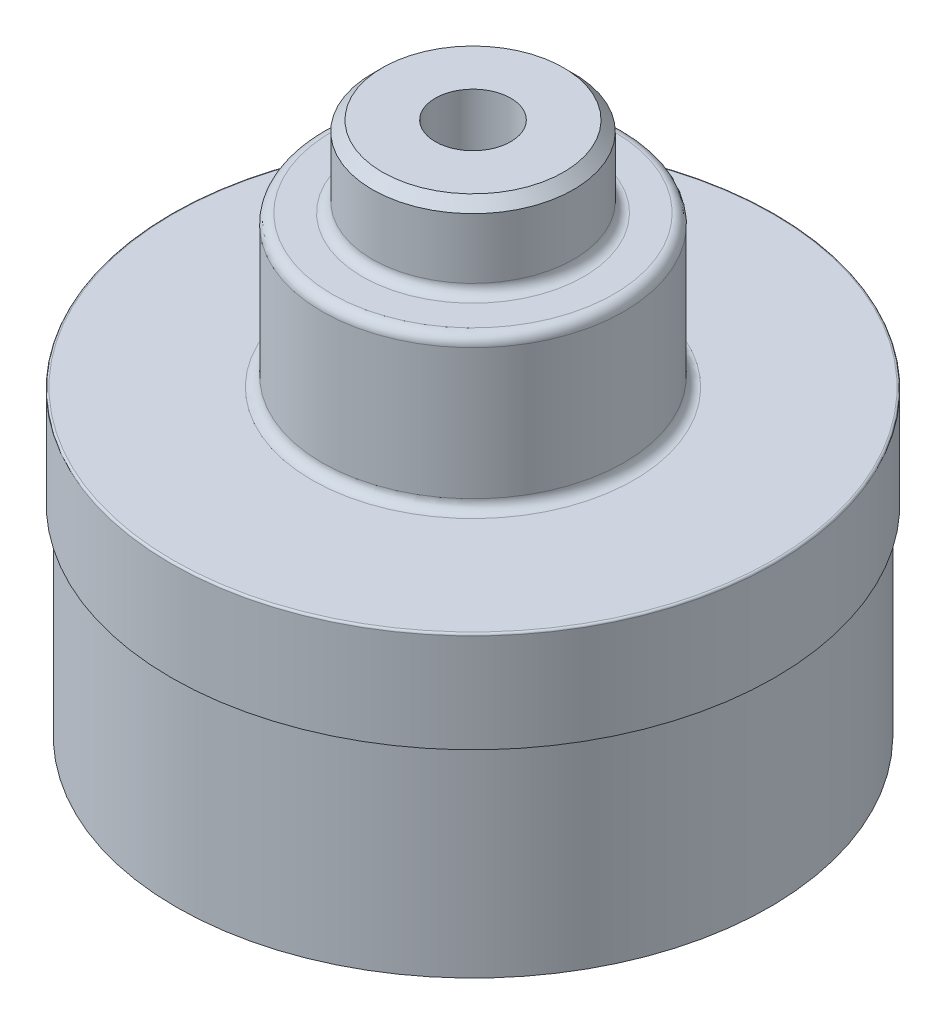
ISO-10303-21;
HEADER;
FILE_DESCRIPTION(('STEP AP214'),'2;1');
FILE_NAME('part.step','',(''),(''),'','','');
FILE_SCHEMA(('AUTOMOTIVE_DESIGN { 1 0 10303 214 1 1 1 1 }'));
ENDSEC;
DATA;
#1=APPLICATION_CONTEXT('core data for automotive mechanical design processes');
#2=APPLICATION_PROTOCOL_DEFINITION('international standard','automotive_design',2000,#1);
#3=PRODUCT_CONTEXT('',#1,'mechanical');
#4=PRODUCT('Part','Part','',(#3));
#5=PRODUCT_RELATED_PRODUCT_CATEGORY('part','',(#4));
#6=PRODUCT_DEFINITION_FORMATION('','',#4);
#7=PRODUCT_DEFINITION_CONTEXT('part definition',#1,'design');
#8=PRODUCT_DEFINITION('design','',#6,#7);
#9=PRODUCT_DEFINITION_SHAPE('','',#8);
#10=(LENGTH_UNIT() NAMED_UNIT(*) SI_UNIT(.MILLI.,.METRE.));
#11=(NAMED_UNIT(*) PLANE_ANGLE_UNIT() SI_UNIT($,.RADIAN.));
#12=(NAMED_UNIT(*) SI_UNIT($,.STERADIAN.) SOLID_ANGLE_UNIT());
#13=UNCERTAINTY_MEASURE_WITH_UNIT(LENGTH_MEASURE(1.E-05),#10,'distance_accuracy_value','');
#14=(GEOMETRIC_REPRESENTATION_CONTEXT(3) GLOBAL_UNCERTAINTY_ASSIGNED_CONTEXT((#13)) GLOBAL_UNIT_ASSIGNED_CONTEXT((#10,
#11,#12)) REPRESENTATION_CONTEXT('',''));
#15=CARTESIAN_POINT('',(0.,0.,0.));
#16=DIRECTION('',(0.,0.,1.));
#17=DIRECTION('',(1.,0.,0.));
#18=AXIS2_PLACEMENT_3D('',#15,#16,#17);
#19=CARTESIAN_POINT('',(0.,25.4,0.));
#20=DIRECTION('',(0.,-1.,0.));
#21=DIRECTION('',(0.,0.,-1.));
#22=AXIS2_PLACEMENT_3D('',#19,#20,#21);
#23=CYLINDRICAL_SURFACE('',#22,37.465);
#24=CARTESIAN_POINT('',(0.,25.4,0.));
#25=DIRECTION('',(0.,1.,0.));
#26=DIRECTION('',(0.,0.,1.));
#27=AXIS2_PLACEMENT_3D('',#24,#25,#26);
#28=CIRCLE('',#27,37.465);
#29=CARTESIAN_POINT('',(0.,25.4,37.465));
#30=VERTEX_POINT('',#29);
#31=EDGE_CURVE('E65',#30,#30,#28,.T.);
#32=ORIENTED_EDGE('',*,*,#31,.F.);
#33=EDGE_LOOP('',(#32));
#34=FACE_BOUND('',#33,.T.);
#35=CARTESIAN_POINT('',(0.,0.,0.));
#36=DIRECTION('',(0.,1.,0.));
#37=DIRECTION('',(0.,0.,1.));
#38=AXIS2_PLACEMENT_3D('',#35,#36,#37);
#39=CIRCLE('',#38,37.465);
#40=CARTESIAN_POINT('',(0.,0.,37.465));
#41=VERTEX_POINT('',#40);
#42=EDGE_CURVE('E60',#41,#41,#39,.T.);
#43=ORIENTED_EDGE('',*,*,#42,.T.);
#44=EDGE_LOOP('',(#43));
#45=FACE_BOUND('',#44,.T.);
#46=ADVANCED_FACE('F37',(#34,#45),#23,.T.);
#47=CARTESIAN_POINT('',(0.,0.,0.));
#48=DIRECTION('',(0.,1.,0.));
#49=DIRECTION('',(0.,0.,1.));
#50=AXIS2_PLACEMENT_3D('',#47,#48,#49);
#51=PLANE('',#50);
#52=ORIENTED_EDGE('',*,*,#42,.F.);
#53=EDGE_LOOP('',(#52));
#54=FACE_BOUND('',#53,.T.);
#55=ADVANCED_FACE('F109',(#54),#51,.F.);
#56=CARTESIAN_POINT('',(0.,38.1,0.));
#57=DIRECTION('',(0.,-1.,0.));
#58=DIRECTION('',(0.,0.,-1.));
#59=AXIS2_PLACEMENT_3D('',#56,#57,#58);
#60=CYLINDRICAL_SURFACE('',#59,38.1);
#61=CARTESIAN_POINT('',(0.,37.846,0.));
#62=DIRECTION('',(0.,1.,0.));
#63=DIRECTION('',(0.,0.,1.));
#64=AXIS2_PLACEMENT_3D('',#61,#62,#63);
#65=CIRCLE('',#64,38.1);
#66=CARTESIAN_POINT('',(0.,37.846,38.1));
#67=VERTEX_POINT('',#66);
#68=EDGE_CURVE('E85',#67,#67,#65,.F.);
#69=ORIENTED_EDGE('',*,*,#68,.T.);
#70=EDGE_LOOP('',(#69));
#71=FACE_BOUND('',#70,.T.);
#72=CARTESIAN_POINT('',(0.,25.4,0.));
#73=DIRECTION('',(0.,1.,0.));
#74=DIRECTION('',(0.,0.,1.));
#75=AXIS2_PLACEMENT_3D('',#72,#73,#74);
#76=CIRCLE('',#75,38.1);
#77=CARTESIAN_POINT('',(0.,25.4,38.1));
#78=VERTEX_POINT('',#77);
#79=EDGE_CURVE('E56',#78,#78,#76,.T.);
#80=ORIENTED_EDGE('',*,*,#79,.T.);
#81=EDGE_LOOP('',(#80));
#82=FACE_BOUND('',#81,.T.);
#83=ADVANCED_FACE('F115',(#71,#82),#60,.T.);
#84=CARTESIAN_POINT('',(0.,38.1,0.));
#85=DIRECTION('',(0.,1.,0.));
#86=DIRECTION('',(0.,0.,1.));
#87=AXIS2_PLACEMENT_3D('',#84,#85,#86);
#88=PLANE('',#87);
#89=CARTESIAN_POINT('',(0.,38.1,0.));
#90=DIRECTION('',(0.,1.,0.));
#91=DIRECTION('',(0.,0.,1.));
#92=AXIS2_PLACEMENT_3D('',#89,#90,#91);
#93=CIRCLE('',#92,20.32);
#94=CARTESIAN_POINT('',(0.,38.1,20.32));
#95=VERTEX_POINT('',#94);
#96=EDGE_CURVE('E91',#95,#95,#93,.F.);
#97=ORIENTED_EDGE('',*,*,#96,.T.);
#98=EDGE_LOOP('',(#97));
#99=FACE_BOUND('',#98,.T.);
#100=CARTESIAN_POINT('',(0.,38.1,0.));
#101=DIRECTION('',(0.,1.,0.));
#102=DIRECTION('',(0.,0.,1.));
#103=AXIS2_PLACEMENT_3D('',#100,#101,#102);
#104=CIRCLE('',#103,37.846);
#105=CARTESIAN_POINT('',(0.,38.1,37.846));
#106=VERTEX_POINT('',#105);
#107=EDGE_CURVE('E82',#106,#106,#104,.T.);
#108=ORIENTED_EDGE('',*,*,#107,.T.);
#109=EDGE_LOOP('',(#108));
#110=FACE_BOUND('',#109,.T.);
#111=ADVANCED_FACE('F139',(#99,#110),#88,.T.);
#112=CARTESIAN_POINT('',(0.,25.4,0.));
#113=DIRECTION('',(0.,1.,0.));
#114=DIRECTION('',(0.,0.,1.));
#115=AXIS2_PLACEMENT_3D('',#112,#113,#114);
#116=PLANE('',#115);
#117=ORIENTED_EDGE('',*,*,#31,.T.);
#118=EDGE_LOOP('',(#117));
#119=FACE_BOUND('',#118,.T.);
#120=ORIENTED_EDGE('',*,*,#79,.F.);
#121=EDGE_LOOP('',(#120));
#122=FACE_BOUND('',#121,.T.);
#123=ADVANCED_FACE('F141',(#119,#122),#116,.F.);
#124=CARTESIAN_POINT('',(0.,57.15,0.));
#125=DIRECTION('',(0.,-1.,0.));
#126=DIRECTION('',(0.,0.,-1.));
#127=AXIS2_PLACEMENT_3D('',#124,#125,#126);
#128=CYLINDRICAL_SURFACE('',#127,19.05);
#129=CARTESIAN_POINT('',(0.,39.37,0.));
#130=DIRECTION('',(0.,1.,0.));
#131=DIRECTION('',(0.,0.,1.));
#132=AXIS2_PLACEMENT_3D('',#129,#130,#131);
#133=CIRCLE('',#132,19.05);
#134=CARTESIAN_POINT('',(0.,39.37,-19.05));
#135=VERTEX_POINT('',#134);
#136=EDGE_CURVE('E88',#135,#135,#133,.T.);
#137=CARTESIAN_POINT('',(0.,55.88,0.));
#138=DIRECTION('',(0.,1.,0.));
#139=DIRECTION('',(0.,0.,1.));
#140=AXIS2_PLACEMENT_3D('',#137,#138,#139);
#141=CIRCLE('',#140,19.05);
#142=CARTESIAN_POINT('',(0.,55.88,-19.05));
#143=VERTEX_POINT('',#142);
#144=EDGE_CURVE('E79',#143,#143,#141,.F.);
#145=CARTESIAN_POINT('',(0.,39.37,-19.05));
#146=CARTESIAN_POINT('',(0.,39.5419791666667,-19.05));
#147=CARTESIAN_POINT('',(0.,39.7139583333333,-19.05));
#148=CARTESIAN_POINT('',(0.,40.0579166666667,-19.05));
#149=CARTESIAN_POINT('',(0.,40.2298958333333,-19.05));
#150=CARTESIAN_POINT('',(0.,40.5738541666667,-19.05));
#151=CARTESIAN_POINT('',(0.,40.7458333333333,-19.05));
#152=CARTESIAN_POINT('',(0.,41.0897916666667,-19.05));
#153=CARTESIAN_POINT('',(0.,41.2617708333333,-19.05));
#154=CARTESIAN_POINT('',(0.,41.6057291666667,-19.05));
#155=CARTESIAN_POINT('',(0.,41.7777083333333,-19.05));
#156=CARTESIAN_POINT('',(0.,42.1216666666667,-19.05));
#157=CARTESIAN_POINT('',(0.,42.2936458333333,-19.05));
#158=CARTESIAN_POINT('',(0.,42.6376041666667,-19.05));
#159=CARTESIAN_POINT('',(0.,42.8095833333333,-19.05));
#160=CARTESIAN_POINT('',(0.,43.1535416666667,-19.05));
#161=CARTESIAN_POINT('',(0.,43.3255208333333,-19.05));
#162=CARTESIAN_POINT('',(0.,43.6694791666667,-19.05));
#163=CARTESIAN_POINT('',(0.,43.8414583333333,-19.05));
#164=CARTESIAN_POINT('',(0.,44.1854166666667,-19.05));
#165=CARTESIAN_POINT('',(0.,44.3573958333333,-19.05));
#166=CARTESIAN_POINT('',(0.,44.7013541666667,-19.05));
#167=CARTESIAN_POINT('',(0.,44.8733333333333,-19.05));
#168=CARTESIAN_POINT('',(0.,45.2172916666667,-19.05));
#169=CARTESIAN_POINT('',(0.,45.3892708333333,-19.05));
#170=CARTESIAN_POINT('',(0.,45.7332291666667,-19.05));
#171=CARTESIAN_POINT('',(0.,45.9052083333333,-19.05));
#172=CARTESIAN_POINT('',(0.,46.2491666666667,-19.05));
#173=CARTESIAN_POINT('',(0.,46.4211458333333,-19.05));
#174=CARTESIAN_POINT('',(0.,46.7651041666667,-19.05));
#175=CARTESIAN_POINT('',(0.,46.9370833333333,-19.05));
#176=CARTESIAN_POINT('',(0.,47.2810416666667,-19.05));
#177=CARTESIAN_POINT('',(0.,47.4530208333333,-19.05));
#178=CARTESIAN_POINT('',(0.,47.7969791666667,-19.05));
#179=CARTESIAN_POINT('',(0.,47.9689583333333,-19.05));
#180=CARTESIAN_POINT('',(0.,48.3129166666667,-19.05));
#181=CARTESIAN_POINT('',(0.,48.4848958333333,-19.05));
#182=CARTESIAN_POINT('',(0.,48.8288541666667,-19.05));
#183=CARTESIAN_POINT('',(0.,49.0008333333333,-19.05));
#184=CARTESIAN_POINT('',(0.,49.3447916666667,-19.05));
#185=CARTESIAN_POINT('',(0.,49.5167708333333,-19.05));
#186=CARTESIAN_POINT('',(0.,49.8607291666667,-19.05));
#187=CARTESIAN_POINT('',(0.,50.0327083333333,-19.05));
#188=CARTESIAN_POINT('',(0.,50.3766666666667,-19.05));
#189=CARTESIAN_POINT('',(0.,50.5486458333333,-19.05));
#190=CARTESIAN_POINT('',(0.,50.8926041666667,-19.05));
#191=CARTESIAN_POINT('',(0.,51.0645833333333,-19.05));
#192=CARTESIAN_POINT('',(0.,51.4085416666667,-19.05));
#193=CARTESIAN_POINT('',(0.,51.5805208333333,-19.05));
#194=CARTESIAN_POINT('',(0.,51.9244791666667,-19.05));
#195=CARTESIAN_POINT('',(0.,52.0964583333333,-19.05));
#196=CARTESIAN_POINT('',(0.,52.4404166666667,-19.05));
#197=CARTESIAN_POINT('',(0.,52.6123958333333,-19.05));
#198=CARTESIAN_POINT('',(0.,52.9563541666667,-19.05));
#199=CARTESIAN_POINT('',(0.,53.1283333333333,-19.05));
#200=CARTESIAN_POINT('',(0.,53.4722916666667,-19.05));
#201=CARTESIAN_POINT('',(0.,53.6442708333333,-19.05));
#202=CARTESIAN_POINT('',(0.,53.9882291666667,-19.05));
#203=CARTESIAN_POINT('',(0.,54.1602083333333,-19.05));
#204=CARTESIAN_POINT('',(0.,54.5041666666667,-19.05));
#205=CARTESIAN_POINT('',(0.,54.6761458333333,-19.05));
#206=CARTESIAN_POINT('',(0.,55.0201041666667,-19.05));
#207=CARTESIAN_POINT('',(0.,55.1920833333333,-19.05));
#208=CARTESIAN_POINT('',(0.,55.5360416666667,-19.05));
#209=CARTESIAN_POINT('',(0.,55.7080208333333,-19.05));
#210=CARTESIAN_POINT('',(0.,55.88,-19.05));
#211=B_SPLINE_CURVE_WITH_KNOTS('',3,(#145,#146,#147,#148,#149,#150,#151,#152,#153,#154,#155,
#156,#157,#158,#159,#160,#161,#162,#163,#164,#165,#166,#167,#168,#169,#170,#171,#172,#173,#174,
#175,#176,#177,#178,#179,#180,#181,#182,#183,#184,#185,#186,#187,#188,#189,#190,#191,#192,#193,
#194,#195,#196,#197,#198,#199,#200,#201,#202,#203,#204,#205,#206,#207,#208,#209,#210),
.UNSPECIFIED.,.F.,.F.,(4,2,2,2,2,2,2,2,2,2,2,2,2,2,2,2,2,2,2,2,2,2,2,2,2,2,2,2,2,2,2,2,4),(0.,
0.515937500000008,1.031875,1.5478125,2.06375,2.5796875,3.095625,3.6115625,4.1275,4.6434375,
5.159375,5.6753125,6.19125,6.7071875,7.223125,7.7390625,8.255,8.77093750000001,9.286875,
9.8028125,10.31875,10.8346875,11.350625,11.8665625,12.3825,12.8984375,13.414375,13.9303125,
14.44625,14.9621875,15.478125,15.9940625,16.51),.UNSPECIFIED.);
#212=EDGE_CURVE('BSEAM148',#135,#143,#211,.T.);
#213=ORIENTED_EDGE('',*,*,#136,.T.);
#214=ORIENTED_EDGE('',*,*,#144,.T.);
#215=ORIENTED_EDGE('',*,*,#212,.T.);
#216=ORIENTED_EDGE('',*,*,#212,.F.);
#217=EDGE_LOOP('',(#213,#215,#214,#216));
#218=FACE_BOUND('',#217,.T.);
#219=ADVANCED_FACE('F148',(#218),#128,.T.);
#220=CARTESIAN_POINT('',(0.,57.15,0.));
#221=DIRECTION('',(0.,1.,0.));
#222=DIRECTION('',(0.,0.,1.));
#223=AXIS2_PLACEMENT_3D('',#220,#221,#222);
#224=PLANE('',#223);
#225=CARTESIAN_POINT('',(0.,57.15,0.));
#226=DIRECTION('',(0.,1.,0.));
#227=DIRECTION('',(0.,0.,1.));
#228=AXIS2_PLACEMENT_3D('',#225,#226,#227);
#229=CIRCLE('',#228,13.97);
#230=CARTESIAN_POINT('',(0.,57.15,13.97));
#231=VERTEX_POINT('',#230);
#232=EDGE_CURVE('E13',#231,#231,#229,.F.);
#233=ORIENTED_EDGE('',*,*,#232,.T.);
#234=EDGE_LOOP('',(#233));
#235=FACE_BOUND('',#234,.T.);
#236=CARTESIAN_POINT('',(0.,57.15,0.));
#237=DIRECTION('',(0.,1.,0.));
#238=DIRECTION('',(0.,0.,1.));
#239=AXIS2_PLACEMENT_3D('',#236,#237,#238);
#240=CIRCLE('',#239,17.78);
#241=CARTESIAN_POINT('',(0.,57.15,17.78));
#242=VERTEX_POINT('',#241);
#243=EDGE_CURVE('E76',#242,#242,#240,.T.);
#244=ORIENTED_EDGE('',*,*,#243,.T.);
#245=EDGE_LOOP('',(#244));
#246=FACE_BOUND('',#245,.T.);
#247=ADVANCED_FACE('F155',(#235,#246),#224,.T.);
#248=CARTESIAN_POINT('',(0.,67.31,0.));
#249=DIRECTION('',(0.,-1.,0.));
#250=DIRECTION('',(0.,0.,-1.));
#251=AXIS2_PLACEMENT_3D('',#248,#249,#250);
#252=CYLINDRICAL_SURFACE('',#251,12.7);
#253=CARTESIAN_POINT('',(0.,58.42,0.));
#254=DIRECTION('',(0.,1.,0.));
#255=DIRECTION('',(0.,0.,1.));
#256=AXIS2_PLACEMENT_3D('',#253,#254,#255);
#257=CIRCLE('',#256,12.7);
#258=CARTESIAN_POINT('',(0.,58.42,12.7));
#259=VERTEX_POINT('',#258);
#260=EDGE_CURVE('E44',#259,#259,#257,.T.);
#261=ORIENTED_EDGE('',*,*,#260,.T.);
#262=EDGE_LOOP('',(#261));
#263=FACE_BOUND('',#262,.T.);
#264=CARTESIAN_POINT('',(0.,66.04,0.));
#265=DIRECTION('',(0.,1.,0.));
#266=DIRECTION('',(0.,0.,1.));
#267=AXIS2_PLACEMENT_3D('',#264,#265,#266);
#268=CIRCLE('',#267,12.7);
#269=CARTESIAN_POINT('',(0.,66.04,12.7));
#270=VERTEX_POINT('',#269);
#271=EDGE_CURVE('E73',#270,#270,#268,.F.);
#272=ORIENTED_EDGE('',*,*,#271,.T.);
#273=EDGE_LOOP('',(#272));
#274=FACE_BOUND('',#273,.T.);
#275=ADVANCED_FACE('F96',(#263,#274),#252,.T.);
#276=CARTESIAN_POINT('',(0.,67.31,0.));
#277=DIRECTION('',(0.,1.,0.));
#278=DIRECTION('',(0.,0.,1.));
#279=AXIS2_PLACEMENT_3D('',#276,#277,#278);
#280=PLANE('',#279);
#281=CARTESIAN_POINT('',(0.,67.31,0.));
#282=DIRECTION('',(0.,1.,0.));
#283=DIRECTION('',(0.,0.,1.));
#284=AXIS2_PLACEMENT_3D('',#281,#282,#283);
#285=CIRCLE('',#284,4.76249999999999);
#286=CARTESIAN_POINT('',(0.,67.31,4.76249999999999));
#287=VERTEX_POINT('',#286);
#288=EDGE_CURVE('E57',#287,#287,#285,.T.);
#289=ORIENTED_EDGE('',*,*,#288,.F.);
#290=EDGE_LOOP('',(#289));
#291=FACE_BOUND('',#290,.T.);
#292=CARTESIAN_POINT('',(0.,67.31,0.));
#293=DIRECTION('',(0.,1.,0.));
#294=DIRECTION('',(0.,0.,1.));
#295=AXIS2_PLACEMENT_3D('',#292,#293,#294);
#296=CIRCLE('',#295,11.43);
#297=CARTESIAN_POINT('',(0.,67.31,11.43));
#298=VERTEX_POINT('',#297);
#299=EDGE_CURVE('E68',#298,#298,#296,.T.);
#300=ORIENTED_EDGE('',*,*,#299,.T.);
#301=EDGE_LOOP('',(#300));
#302=FACE_BOUND('',#301,.T.);
#303=ADVANCED_FACE('F126',(#291,#302),#280,.T.);
#304=CARTESIAN_POINT('',(0.,67.31,0.));
#305=DIRECTION('',(0.,-1.,0.));
#306=DIRECTION('',(0.,0.,-1.));
#307=AXIS2_PLACEMENT_3D('',#304,#305,#306);
#308=CONICAL_SURFACE('',#307,11.43,0.785398163397451);
#309=ORIENTED_EDGE('',*,*,#271,.F.);
#310=EDGE_LOOP('',(#309));
#311=FACE_BOUND('',#310,.T.);
#312=ORIENTED_EDGE('',*,*,#299,.F.);
#313=EDGE_LOOP('',(#312));
#314=FACE_BOUND('',#313,.T.);
#315=ADVANCED_FACE('F122',(#311,#314),#308,.T.);
#316=CARTESIAN_POINT('',(0.,55.88,0.));
#317=DIRECTION('',(0.,1.,0.));
#318=DIRECTION('',(0.,0.,1.));
#319=AXIS2_PLACEMENT_3D('',#316,#317,#318);
#320=TOROIDAL_SURFACE('',#319,17.78,1.27);
#321=ORIENTED_EDGE('',*,*,#144,.F.);
#322=EDGE_LOOP('',(#321));
#323=FACE_BOUND('',#322,.T.);
#324=ORIENTED_EDGE('',*,*,#243,.F.);
#325=EDGE_LOOP('',(#324));
#326=FACE_BOUND('',#325,.T.);
#327=ADVANCED_FACE('F125',(#323,#326),#320,.T.);
#328=CARTESIAN_POINT('',(0.,37.846,0.));
#329=DIRECTION('',(0.,1.,0.));
#330=DIRECTION('',(0.,0.,1.));
#331=AXIS2_PLACEMENT_3D('',#328,#329,#330);
#332=TOROIDAL_SURFACE('',#331,37.846,0.254);
#333=ORIENTED_EDGE('',*,*,#68,.F.);
#334=EDGE_LOOP('',(#333));
#335=FACE_BOUND('',#334,.T.);
#336=ORIENTED_EDGE('',*,*,#107,.F.);
#337=EDGE_LOOP('',(#336));
#338=FACE_BOUND('',#337,.T.);
#339=ADVANCED_FACE('F105',(#335,#338),#332,.T.);
#340=CARTESIAN_POINT('',(0.,39.37,0.));
#341=DIRECTION('',(0.,1.,0.));
#342=DIRECTION('',(0.,0.,1.));
#343=AXIS2_PLACEMENT_3D('',#340,#341,#342);
#344=TOROIDAL_SURFACE('',#343,20.32,1.27);
#345=ORIENTED_EDGE('',*,*,#96,.F.);
#346=EDGE_LOOP('',(#345));
#347=FACE_BOUND('',#346,.T.);
#348=ORIENTED_EDGE('',*,*,#136,.F.);
#349=EDGE_LOOP('',(#348));
#350=FACE_BOUND('',#349,.T.);
#351=ADVANCED_FACE('F100',(#347,#350),#344,.F.);
#352=CARTESIAN_POINT('',(0.,58.42,0.));
#353=DIRECTION('',(0.,1.,0.));
#354=DIRECTION('',(0.,0.,1.));
#355=AXIS2_PLACEMENT_3D('',#352,#353,#354);
#356=TOROIDAL_SURFACE('',#355,13.97,1.27);
#357=ORIENTED_EDGE('',*,*,#232,.F.);
#358=EDGE_LOOP('',(#357));
#359=FACE_BOUND('',#358,.T.);
#360=ORIENTED_EDGE('',*,*,#260,.F.);
#361=EDGE_LOOP('',(#360));
#362=FACE_BOUND('',#361,.T.);
#363=ADVANCED_FACE('F39',(#359,#362),#356,.F.);
#364=CARTESIAN_POINT('',(0.,41.91,0.));
#365=DIRECTION('',(0.,1.,0.));
#366=DIRECTION('',(0.,0.,1.));
#367=AXIS2_PLACEMENT_3D('',#364,#365,#366);
#368=CONICAL_SURFACE('',#367,4.76249999999999,1.02974425867665);
#369=CARTESIAN_POINT('',(0.,39.0484013018812,0.));
#370=VERTEX_POINT('',#369);
#371=VERTEX_LOOP('',#370);
#372=FACE_BOUND('',#371,.T.);
#373=CARTESIAN_POINT('',(0.,41.91,0.));
#374=DIRECTION('',(0.,1.,0.));
#375=DIRECTION('',(0.,0.,1.));
#376=AXIS2_PLACEMENT_3D('',#373,#374,#375);
#377=CIRCLE('',#376,4.76249999999999);
#378=CARTESIAN_POINT('',(0.,41.91,4.76249999999999));
#379=VERTEX_POINT('',#378);
#380=EDGE_CURVE('E54',#379,#379,#377,.T.);
#381=ORIENTED_EDGE('',*,*,#380,.T.);
#382=EDGE_LOOP('',(#381));
#383=FACE_BOUND('',#382,.T.);
#384=ADVANCED_FACE('F47',(#372,#383),#368,.F.);
#385=CARTESIAN_POINT('',(0.,67.31,0.));
#386=DIRECTION('',(0.,1.,0.));
#387=DIRECTION('',(0.,0.,1.));
#388=AXIS2_PLACEMENT_3D('',#385,#386,#387);
#389=CYLINDRICAL_SURFACE('',#388,4.76249999999999);
#390=ORIENTED_EDGE('',*,*,#380,.F.);
#391=EDGE_LOOP('',(#390));
#392=FACE_BOUND('',#391,.T.);
#393=ORIENTED_EDGE('',*,*,#288,.T.);
#394=EDGE_LOOP('',(#393));
#395=FACE_BOUND('',#394,.T.);
#396=ADVANCED_FACE('F50',(#392,#395),#389,.F.);
#397=CLOSED_SHELL('',(#46,#55,#83,#111,#123,#219,#247,#275,#303,#315,#327,#339,#351,#363,#384,#396));
#398=MANIFOLD_SOLID_BREP('B2',#397);
#399=ADVANCED_BREP_SHAPE_REPRESENTATION('',(#18,#398),#14);
#400=SHAPE_DEFINITION_REPRESENTATION(#9,#399);
ENDSEC;
END-ISO-10303-21;
